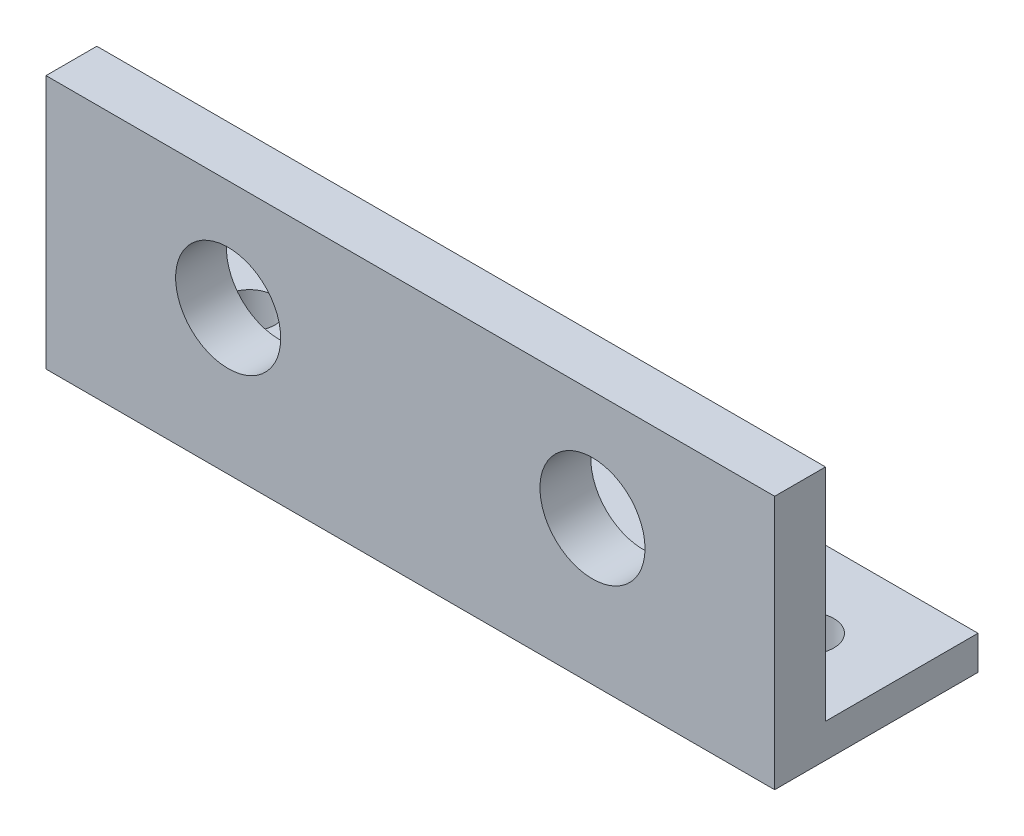
ISO-10303-21;
HEADER;
FILE_DESCRIPTION(('STEP AP214'),'2;1');
FILE_NAME('part.step','',(''),(''),'','','');
FILE_SCHEMA(('AUTOMOTIVE_DESIGN { 1 0 10303 214 1 1 1 1 }'));
ENDSEC;
DATA;
#1=APPLICATION_CONTEXT('core data for automotive mechanical design processes');
#2=APPLICATION_PROTOCOL_DEFINITION('international standard','automotive_design',2000,#1);
#3=PRODUCT_CONTEXT('',#1,'mechanical');
#4=PRODUCT('Part','Part','',(#3));
#5=PRODUCT_RELATED_PRODUCT_CATEGORY('part','',(#4));
#6=PRODUCT_DEFINITION_FORMATION('','',#4);
#7=PRODUCT_DEFINITION_CONTEXT('part definition',#1,'design');
#8=PRODUCT_DEFINITION('design','',#6,#7);
#9=PRODUCT_DEFINITION_SHAPE('','',#8);
#10=(LENGTH_UNIT() NAMED_UNIT(*) SI_UNIT(.MILLI.,.METRE.));
#11=(NAMED_UNIT(*) PLANE_ANGLE_UNIT() SI_UNIT($,.RADIAN.));
#12=(NAMED_UNIT(*) SI_UNIT($,.STERADIAN.) SOLID_ANGLE_UNIT());
#13=UNCERTAINTY_MEASURE_WITH_UNIT(LENGTH_MEASURE(1.E-05),#10,'distance_accuracy_value','');
#14=(GEOMETRIC_REPRESENTATION_CONTEXT(3) GLOBAL_UNCERTAINTY_ASSIGNED_CONTEXT((#13)) GLOBAL_UNIT_ASSIGNED_CONTEXT((#10,
#11,#12)) REPRESENTATION_CONTEXT('',''));
#15=CARTESIAN_POINT('',(0.,0.,0.));
#16=DIRECTION('',(0.,0.,1.));
#17=DIRECTION('',(1.,0.,0.));
#18=AXIS2_PLACEMENT_3D('',#15,#16,#17);
#19=CARTESIAN_POINT('',(0.,2.,7.));
#20=DIRECTION('',(0.,0.,1.));
#21=DIRECTION('',(1.,0.,0.));
#22=AXIS2_PLACEMENT_3D('',#19,#20,#21);
#23=PLANE('',#22);
#24=CARTESIAN_POINT('',(-5.75,8.5,7.));
#25=DIRECTION('',(0.,0.,1.));
#26=DIRECTION('',(1.,0.,0.));
#27=AXIS2_PLACEMENT_3D('',#24,#25,#26);
#28=CIRCLE('',#27,3.1);
#29=CARTESIAN_POINT('',(-2.65,8.5,7.));
#30=VERTEX_POINT('',#29);
#31=EDGE_CURVE('E130',#30,#30,#28,.T.);
#32=ORIENTED_EDGE('',*,*,#31,.F.);
#33=EDGE_LOOP('',(#32));
#34=FACE_BOUND('',#33,.T.);
#35=CARTESIAN_POINT('',(-27.25,8.5,7.));
#36=DIRECTION('',(0.,0.,1.));
#37=DIRECTION('',(1.,0.,0.));
#38=AXIS2_PLACEMENT_3D('',#35,#36,#37);
#39=CIRCLE('',#38,3.1);
#40=CARTESIAN_POINT('',(-24.15,8.5,7.));
#41=VERTEX_POINT('',#40);
#42=EDGE_CURVE('E137',#41,#41,#39,.T.);
#43=ORIENTED_EDGE('',*,*,#42,.F.);
#44=EDGE_LOOP('',(#43));
#45=FACE_BOUND('',#44,.T.);
#46=DIRECTION('',(-1.,0.,0.));
#47=VECTOR('',#46,1.);
#48=CARTESIAN_POINT('',(0.,0.,7.));
#49=LINE('',#48,#47);
#50=CARTESIAN_POINT('',(5.,0.,7.));
#51=VERTEX_POINT('',#50);
#52=CARTESIAN_POINT('',(-38.,0.,7.));
#53=VERTEX_POINT('',#52);
#54=EDGE_CURVE('E88',#51,#53,#49,.T.);
#55=ORIENTED_EDGE('',*,*,#54,.F.);
#56=DIRECTION('',(0.,-1.,0.));
#57=VECTOR('',#56,1.);
#58=CARTESIAN_POINT('',(5.,2.,7.));
#59=LINE('',#58,#57);
#60=CARTESIAN_POINT('',(5.,15.,7.));
#61=VERTEX_POINT('',#60);
#62=EDGE_CURVE('E11',#61,#51,#59,.T.);
#63=ORIENTED_EDGE('',*,*,#62,.F.);
#64=DIRECTION('',(1.,0.,0.));
#65=VECTOR('',#64,1.);
#66=CARTESIAN_POINT('',(5.,15.,7.));
#67=LINE('',#66,#65);
#68=CARTESIAN_POINT('',(-38.,15.,7.));
#69=VERTEX_POINT('',#68);
#70=EDGE_CURVE('E90',#69,#61,#67,.T.);
#71=ORIENTED_EDGE('',*,*,#70,.F.);
#72=DIRECTION('',(0.,-1.,0.));
#73=VECTOR('',#72,1.);
#74=CARTESIAN_POINT('',(-38.,2.,7.));
#75=LINE('',#74,#73);
#76=EDGE_CURVE('E85',#69,#53,#75,.T.);
#77=ORIENTED_EDGE('',*,*,#76,.T.);
#78=EDGE_LOOP('',(#55,#63,#71,#77));
#79=FACE_BOUND('',#78,.T.);
#80=ADVANCED_FACE('F41',(#34,#45,#79),#23,.T.);
#81=CARTESIAN_POINT('',(5.,2.,0.));
#82=DIRECTION('',(-1.,0.,0.));
#83=DIRECTION('',(0.,0.,1.));
#84=AXIS2_PLACEMENT_3D('',#81,#82,#83);
#85=PLANE('',#84);
#86=DIRECTION('',(0.,0.,-1.));
#87=VECTOR('',#86,1.);
#88=CARTESIAN_POINT('',(5.,0.,0.));
#89=LINE('',#88,#87);
#90=CARTESIAN_POINT('',(5.,0.,-5.));
#91=VERTEX_POINT('',#90);
#92=EDGE_CURVE('E106',#51,#91,#89,.T.);
#93=ORIENTED_EDGE('',*,*,#92,.T.);
#94=DIRECTION('',(0.,-1.,0.));
#95=VECTOR('',#94,1.);
#96=CARTESIAN_POINT('',(5.,2.,-5.));
#97=LINE('',#96,#95);
#98=CARTESIAN_POINT('',(5.,2.,-5.));
#99=VERTEX_POINT('',#98);
#100=EDGE_CURVE('E51',#99,#91,#97,.T.);
#101=ORIENTED_EDGE('',*,*,#100,.F.);
#102=DIRECTION('',(0.,0.,-1.));
#103=VECTOR('',#102,1.);
#104=CARTESIAN_POINT('',(5.,2.,0.));
#105=LINE('',#104,#103);
#106=CARTESIAN_POINT('',(5.,2.,4.));
#107=VERTEX_POINT('',#106);
#108=EDGE_CURVE('E170',#107,#99,#105,.T.);
#109=ORIENTED_EDGE('',*,*,#108,.F.);
#110=DIRECTION('',(0.,-1.,0.));
#111=VECTOR('',#110,1.);
#112=CARTESIAN_POINT('',(5.,15.,4.));
#113=LINE('',#112,#111);
#114=CARTESIAN_POINT('',(5.,15.,4.));
#115=VERTEX_POINT('',#114);
#116=EDGE_CURVE('E163',#115,#107,#113,.T.);
#117=ORIENTED_EDGE('',*,*,#116,.F.);
#118=DIRECTION('',(0.,0.,-1.));
#119=VECTOR('',#118,1.);
#120=CARTESIAN_POINT('',(5.,15.,4.));
#121=LINE('',#120,#119);
#122=EDGE_CURVE('E147',#61,#115,#121,.T.);
#123=ORIENTED_EDGE('',*,*,#122,.F.);
#124=ORIENTED_EDGE('',*,*,#62,.T.);
#125=EDGE_LOOP('',(#93,#101,#109,#117,#123,#124));
#126=FACE_BOUND('',#125,.T.);
#127=ADVANCED_FACE('F187',(#126),#85,.F.);
#128=CARTESIAN_POINT('',(0.,2.,-5.));
#129=DIRECTION('',(0.,0.,-1.));
#130=DIRECTION('',(-1.,0.,0.));
#131=AXIS2_PLACEMENT_3D('',#128,#129,#130);
#132=PLANE('',#131);
#133=DIRECTION('',(1.,0.,0.));
#134=VECTOR('',#133,1.);
#135=CARTESIAN_POINT('',(0.,0.,-5.));
#136=LINE('',#135,#134);
#137=CARTESIAN_POINT('',(-38.,0.,-5.));
#138=VERTEX_POINT('',#137);
#139=EDGE_CURVE('E114',#138,#91,#136,.T.);
#140=ORIENTED_EDGE('',*,*,#139,.F.);
#141=DIRECTION('',(0.,-1.,0.));
#142=VECTOR('',#141,1.);
#143=CARTESIAN_POINT('',(-38.,2.,-5.));
#144=LINE('',#143,#142);
#145=CARTESIAN_POINT('',(-38.,2.,-5.));
#146=VERTEX_POINT('',#145);
#147=EDGE_CURVE('E95',#146,#138,#144,.T.);
#148=ORIENTED_EDGE('',*,*,#147,.F.);
#149=DIRECTION('',(1.,0.,0.));
#150=VECTOR('',#149,1.);
#151=CARTESIAN_POINT('',(0.,2.,-5.));
#152=LINE('',#151,#150);
#153=EDGE_CURVE('E173',#146,#99,#152,.T.);
#154=ORIENTED_EDGE('',*,*,#153,.T.);
#155=ORIENTED_EDGE('',*,*,#100,.T.);
#156=EDGE_LOOP('',(#140,#148,#154,#155));
#157=FACE_BOUND('',#156,.T.);
#158=ADVANCED_FACE('F190',(#157),#132,.T.);
#159=CARTESIAN_POINT('',(-38.,2.,0.));
#160=DIRECTION('',(-1.,0.,0.));
#161=DIRECTION('',(0.,0.,1.));
#162=AXIS2_PLACEMENT_3D('',#159,#160,#161);
#163=PLANE('',#162);
#164=DIRECTION('',(0.,0.,-1.));
#165=VECTOR('',#164,1.);
#166=CARTESIAN_POINT('',(-38.,0.,0.));
#167=LINE('',#166,#165);
#168=EDGE_CURVE('E104',#53,#138,#167,.T.);
#169=ORIENTED_EDGE('',*,*,#168,.F.);
#170=ORIENTED_EDGE('',*,*,#76,.F.);
#171=DIRECTION('',(0.,0.,1.));
#172=VECTOR('',#171,1.);
#173=CARTESIAN_POINT('',(-38.,15.,7.));
#174=LINE('',#173,#172);
#175=CARTESIAN_POINT('',(-38.,15.,4.));
#176=VERTEX_POINT('',#175);
#177=EDGE_CURVE('E155',#176,#69,#174,.T.);
#178=ORIENTED_EDGE('',*,*,#177,.F.);
#179=DIRECTION('',(0.,-1.,0.));
#180=VECTOR('',#179,1.);
#181=CARTESIAN_POINT('',(-38.,15.,4.));
#182=LINE('',#181,#180);
#183=CARTESIAN_POINT('',(-38.,2.,4.));
#184=VERTEX_POINT('',#183);
#185=EDGE_CURVE('E158',#176,#184,#182,.T.);
#186=ORIENTED_EDGE('',*,*,#185,.T.);
#187=DIRECTION('',(0.,0.,-1.));
#188=VECTOR('',#187,1.);
#189=CARTESIAN_POINT('',(-38.,2.,0.));
#190=LINE('',#189,#188);
#191=EDGE_CURVE('E67',#184,#146,#190,.T.);
#192=ORIENTED_EDGE('',*,*,#191,.T.);
#193=ORIENTED_EDGE('',*,*,#147,.T.);
#194=EDGE_LOOP('',(#169,#170,#178,#186,#192,#193));
#195=FACE_BOUND('',#194,.T.);
#196=ADVANCED_FACE('F110',(#195),#163,.T.);
#197=CARTESIAN_POINT('',(-33.,2.,0.));
#198=DIRECTION('',(0.,-1.,0.));
#199=DIRECTION('',(0.,0.,-1.));
#200=AXIS2_PLACEMENT_3D('',#197,#198,#199);
#201=CYLINDRICAL_SURFACE('',#200,1.5);
#202=CARTESIAN_POINT('',(-33.,2.,0.));
#203=DIRECTION('',(0.,1.,0.));
#204=DIRECTION('',(0.,0.,1.));
#205=AXIS2_PLACEMENT_3D('',#202,#203,#204);
#206=CIRCLE('',#205,1.5);
#207=CARTESIAN_POINT('',(-33.,2.,1.5));
#208=VERTEX_POINT('',#207);
#209=EDGE_CURVE('E119',#208,#208,#206,.T.);
#210=ORIENTED_EDGE('',*,*,#209,.T.);
#211=EDGE_LOOP('',(#210));
#212=FACE_BOUND('',#211,.T.);
#213=CARTESIAN_POINT('',(-33.,0.,0.));
#214=DIRECTION('',(0.,1.,0.));
#215=DIRECTION('',(0.,0.,1.));
#216=AXIS2_PLACEMENT_3D('',#213,#214,#215);
#217=CIRCLE('',#216,1.5);
#218=CARTESIAN_POINT('',(-33.,0.,1.5));
#219=VERTEX_POINT('',#218);
#220=EDGE_CURVE('E108',#219,#219,#217,.T.);
#221=ORIENTED_EDGE('',*,*,#220,.F.);
#222=EDGE_LOOP('',(#221));
#223=FACE_BOUND('',#222,.T.);
#224=ADVANCED_FACE('F43',(#212,#223),#201,.F.);
#225=CARTESIAN_POINT('',(0.,2.,0.));
#226=DIRECTION('',(0.,-1.,0.));
#227=DIRECTION('',(0.,0.,-1.));
#228=AXIS2_PLACEMENT_3D('',#225,#226,#227);
#229=CYLINDRICAL_SURFACE('',#228,1.5);
#230=CARTESIAN_POINT('',(0.,2.,0.));
#231=DIRECTION('',(0.,1.,0.));
#232=DIRECTION('',(0.,0.,1.));
#233=AXIS2_PLACEMENT_3D('',#230,#231,#232);
#234=CIRCLE('',#233,1.5);
#235=CARTESIAN_POINT('',(0.,2.,1.5));
#236=VERTEX_POINT('',#235);
#237=EDGE_CURVE('E96',#236,#236,#234,.T.);
#238=ORIENTED_EDGE('',*,*,#237,.T.);
#239=EDGE_LOOP('',(#238));
#240=FACE_BOUND('',#239,.T.);
#241=CARTESIAN_POINT('',(0.,0.,0.));
#242=DIRECTION('',(0.,1.,0.));
#243=DIRECTION('',(0.,0.,1.));
#244=AXIS2_PLACEMENT_3D('',#241,#242,#243);
#245=CIRCLE('',#244,1.5);
#246=CARTESIAN_POINT('',(0.,0.,1.5));
#247=VERTEX_POINT('',#246);
#248=EDGE_CURVE('E113',#247,#247,#245,.T.);
#249=ORIENTED_EDGE('',*,*,#248,.F.);
#250=EDGE_LOOP('',(#249));
#251=FACE_BOUND('',#250,.T.);
#252=ADVANCED_FACE('F233',(#240,#251),#229,.F.);
#253=CARTESIAN_POINT('',(0.,2.,0.));
#254=DIRECTION('',(0.,1.,0.));
#255=DIRECTION('',(0.,0.,1.));
#256=AXIS2_PLACEMENT_3D('',#253,#254,#255);
#257=PLANE('',#256);
#258=DIRECTION('',(-1.,0.,0.));
#259=VECTOR('',#258,1.);
#260=CARTESIAN_POINT('',(-38.,2.,4.));
#261=LINE('',#260,#259);
#262=EDGE_CURVE('E59',#107,#184,#261,.T.);
#263=ORIENTED_EDGE('',*,*,#262,.F.);
#264=ORIENTED_EDGE('',*,*,#108,.T.);
#265=ORIENTED_EDGE('',*,*,#153,.F.);
#266=ORIENTED_EDGE('',*,*,#191,.F.);
#267=EDGE_LOOP('',(#263,#264,#265,#266));
#268=FACE_BOUND('',#267,.T.);
#269=ORIENTED_EDGE('',*,*,#209,.F.);
#270=EDGE_LOOP('',(#269));
#271=FACE_BOUND('',#270,.T.);
#272=ORIENTED_EDGE('',*,*,#237,.F.);
#273=EDGE_LOOP('',(#272));
#274=FACE_BOUND('',#273,.T.);
#275=ADVANCED_FACE('F192',(#268,#271,#274),#257,.T.);
#276=CARTESIAN_POINT('',(0.,0.,0.));
#277=DIRECTION('',(0.,1.,0.));
#278=DIRECTION('',(0.,0.,1.));
#279=AXIS2_PLACEMENT_3D('',#276,#277,#278);
#280=PLANE('',#279);
#281=ORIENTED_EDGE('',*,*,#220,.T.);
#282=EDGE_LOOP('',(#281));
#283=FACE_BOUND('',#282,.T.);
#284=ORIENTED_EDGE('',*,*,#54,.T.);
#285=ORIENTED_EDGE('',*,*,#168,.T.);
#286=ORIENTED_EDGE('',*,*,#139,.T.);
#287=ORIENTED_EDGE('',*,*,#92,.F.);
#288=EDGE_LOOP('',(#284,#285,#286,#287));
#289=FACE_BOUND('',#288,.T.);
#290=ORIENTED_EDGE('',*,*,#248,.T.);
#291=EDGE_LOOP('',(#290));
#292=FACE_BOUND('',#291,.T.);
#293=ADVANCED_FACE('F101',(#283,#289,#292),#280,.F.);
#294=CARTESIAN_POINT('',(-38.,15.,4.));
#295=DIRECTION('',(0.,0.,1.));
#296=DIRECTION('',(1.,0.,0.));
#297=AXIS2_PLACEMENT_3D('',#294,#295,#296);
#298=PLANE('',#297);
#299=CARTESIAN_POINT('',(-5.75,8.5,4.));
#300=DIRECTION('',(0.,0.,1.));
#301=DIRECTION('',(1.,0.,0.));
#302=AXIS2_PLACEMENT_3D('',#299,#300,#301);
#303=CIRCLE('',#302,3.1);
#304=CARTESIAN_POINT('',(-2.65,8.5,4.));
#305=VERTEX_POINT('',#304);
#306=EDGE_CURVE('E45',#305,#305,#303,.T.);
#307=ORIENTED_EDGE('',*,*,#306,.T.);
#308=EDGE_LOOP('',(#307));
#309=FACE_BOUND('',#308,.T.);
#310=CARTESIAN_POINT('',(-27.25,8.5,4.));
#311=DIRECTION('',(0.,0.,1.));
#312=DIRECTION('',(1.,0.,0.));
#313=AXIS2_PLACEMENT_3D('',#310,#311,#312);
#314=CIRCLE('',#313,3.1);
#315=CARTESIAN_POINT('',(-24.15,8.5,4.));
#316=VERTEX_POINT('',#315);
#317=EDGE_CURVE('E127',#316,#316,#314,.T.);
#318=ORIENTED_EDGE('',*,*,#317,.T.);
#319=EDGE_LOOP('',(#318));
#320=FACE_BOUND('',#319,.T.);
#321=ORIENTED_EDGE('',*,*,#262,.T.);
#322=ORIENTED_EDGE('',*,*,#185,.F.);
#323=DIRECTION('',(-1.,0.,0.));
#324=VECTOR('',#323,1.);
#325=CARTESIAN_POINT('',(-38.,15.,4.));
#326=LINE('',#325,#324);
#327=EDGE_CURVE('E151',#115,#176,#326,.T.);
#328=ORIENTED_EDGE('',*,*,#327,.F.);
#329=ORIENTED_EDGE('',*,*,#116,.T.);
#330=EDGE_LOOP('',(#321,#322,#328,#329));
#331=FACE_BOUND('',#330,.T.);
#332=ADVANCED_FACE('F199',(#309,#320,#331),#298,.F.);
#333=CARTESIAN_POINT('',(0.,15.,0.));
#334=DIRECTION('',(0.,-1.,0.));
#335=DIRECTION('',(0.,0.,-1.));
#336=AXIS2_PLACEMENT_3D('',#333,#334,#335);
#337=PLANE('',#336);
#338=ORIENTED_EDGE('',*,*,#70,.T.);
#339=ORIENTED_EDGE('',*,*,#122,.T.);
#340=ORIENTED_EDGE('',*,*,#327,.T.);
#341=ORIENTED_EDGE('',*,*,#177,.T.);
#342=EDGE_LOOP('',(#338,#339,#340,#341));
#343=FACE_BOUND('',#342,.T.);
#344=ADVANCED_FACE('F205',(#343),#337,.F.);
#345=CARTESIAN_POINT('',(-27.25,8.5,-6.));
#346=DIRECTION('',(0.,0.,1.));
#347=DIRECTION('',(1.,0.,0.));
#348=AXIS2_PLACEMENT_3D('',#345,#346,#347);
#349=CYLINDRICAL_SURFACE('',#348,3.1);
#350=ORIENTED_EDGE('',*,*,#42,.T.);
#351=EDGE_LOOP('',(#350));
#352=FACE_BOUND('',#351,.T.);
#353=ORIENTED_EDGE('',*,*,#317,.F.);
#354=EDGE_LOOP('',(#353));
#355=FACE_BOUND('',#354,.T.);
#356=ADVANCED_FACE('F210',(#352,#355),#349,.F.);
#357=CARTESIAN_POINT('',(-5.75,8.5,-6.));
#358=DIRECTION('',(0.,0.,1.));
#359=DIRECTION('',(1.,0.,0.));
#360=AXIS2_PLACEMENT_3D('',#357,#358,#359);
#361=CYLINDRICAL_SURFACE('',#360,3.1);
#362=ORIENTED_EDGE('',*,*,#31,.T.);
#363=EDGE_LOOP('',(#362));
#364=FACE_BOUND('',#363,.T.);
#365=ORIENTED_EDGE('',*,*,#306,.F.);
#366=EDGE_LOOP('',(#365));
#367=FACE_BOUND('',#366,.T.);
#368=ADVANCED_FACE('F216',(#364,#367),#361,.F.);
#369=CLOSED_SHELL('',(#80,#127,#158,#196,#224,#252,#275,#293,#332,#344,#356,#368));
#370=MANIFOLD_SOLID_BREP('B2',#369);
#371=ADVANCED_BREP_SHAPE_REPRESENTATION('',(#18,#370),#14);
#372=SHAPE_DEFINITION_REPRESENTATION(#9,#371);
ENDSEC;
END-ISO-10303-21;
